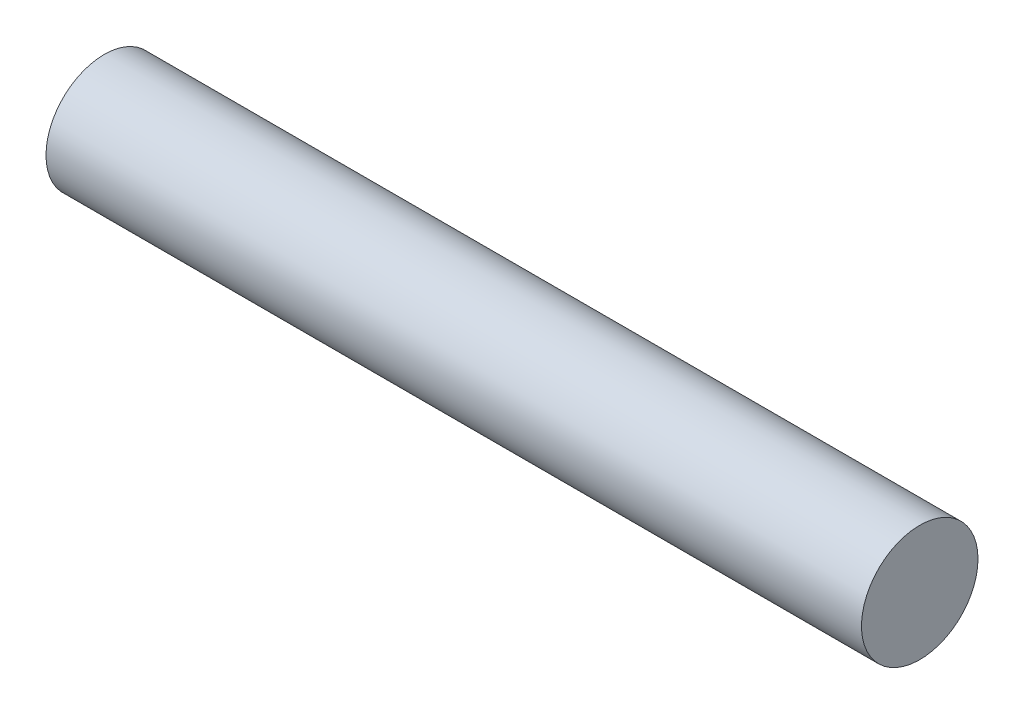
ISO-10303-21;
HEADER;
FILE_DESCRIPTION(('STEP AP214'),'2;1');
FILE_NAME('part.step','',(''),(''),'','','');
FILE_SCHEMA(('AUTOMOTIVE_DESIGN { 1 0 10303 214 1 1 1 1 }'));
ENDSEC;
DATA;
#1=APPLICATION_CONTEXT('core data for automotive mechanical design processes');
#2=APPLICATION_PROTOCOL_DEFINITION('international standard','automotive_design',2000,#1);
#3=PRODUCT_CONTEXT('',#1,'mechanical');
#4=PRODUCT('Part','Part','',(#3));
#5=PRODUCT_RELATED_PRODUCT_CATEGORY('part','',(#4));
#6=PRODUCT_DEFINITION_FORMATION('','',#4);
#7=PRODUCT_DEFINITION_CONTEXT('part definition',#1,'design');
#8=PRODUCT_DEFINITION('design','',#6,#7);
#9=PRODUCT_DEFINITION_SHAPE('','',#8);
#10=(LENGTH_UNIT() NAMED_UNIT(*) SI_UNIT(.MILLI.,.METRE.));
#11=(NAMED_UNIT(*) PLANE_ANGLE_UNIT() SI_UNIT($,.RADIAN.));
#12=(NAMED_UNIT(*) SI_UNIT($,.STERADIAN.) SOLID_ANGLE_UNIT());
#13=UNCERTAINTY_MEASURE_WITH_UNIT(LENGTH_MEASURE(1.E-05),#10,'distance_accuracy_value','');
#14=(GEOMETRIC_REPRESENTATION_CONTEXT(3) GLOBAL_UNCERTAINTY_ASSIGNED_CONTEXT((#13)) GLOBAL_UNIT_ASSIGNED_CONTEXT((#10,
#11,#12)) REPRESENTATION_CONTEXT('',''));
#15=CARTESIAN_POINT('',(0.,0.,0.));
#16=DIRECTION('',(0.,0.,1.));
#17=DIRECTION('',(1.,0.,0.));
#18=AXIS2_PLACEMENT_3D('',#15,#16,#17);
#19=CARTESIAN_POINT('',(-41.275,50.8,-155.801497182376));
#20=DIRECTION('',(-1.,0.,0.));
#21=DIRECTION('',(0.,0.,-1.));
#22=AXIS2_PLACEMENT_3D('',#19,#20,#21);
#23=PLANE('',#22);
#24=CARTESIAN_POINT('',(-41.275,82.55,-123.825));
#25=DIRECTION('',(-1.,0.,0.));
#26=DIRECTION('',(0.,0.,1.));
#27=AXIS2_PLACEMENT_3D('',#24,#25,#26);
#28=CIRCLE('',#27,6.34999999999998);
#29=CARTESIAN_POINT('',(-41.275,82.55,-117.475));
#30=VERTEX_POINT('',#29);
#31=EDGE_CURVE('E10',#30,#30,#28,.F.);
#32=ORIENTED_EDGE('',*,*,#31,.F.);
#33=EDGE_LOOP('',(#32));
#34=FACE_BOUND('',#33,.T.);
#35=ADVANCED_FACE('F35',(#34),#23,.T.);
#36=CARTESIAN_POINT('',(47.625,82.55,-123.825));
#37=DIRECTION('',(1.,0.,0.));
#38=DIRECTION('',(0.,0.,-1.));
#39=AXIS2_PLACEMENT_3D('',#36,#37,#38);
#40=PLANE('',#39);
#41=CARTESIAN_POINT('',(47.625,82.55,-123.825));
#42=DIRECTION('',(1.,0.,0.));
#43=DIRECTION('',(0.,0.,-1.));
#44=AXIS2_PLACEMENT_3D('',#41,#42,#43);
#45=CIRCLE('',#44,6.34999999999998);
#46=CARTESIAN_POINT('',(47.625,82.55,-130.175));
#47=VERTEX_POINT('',#46);
#48=EDGE_CURVE('E41',#47,#47,#45,.T.);
#49=ORIENTED_EDGE('',*,*,#48,.T.);
#50=EDGE_LOOP('',(#49));
#51=FACE_BOUND('',#50,.T.);
#52=ADVANCED_FACE('F47',(#51),#40,.T.);
#53=CARTESIAN_POINT('',(-59.2355122421383,82.55,-123.825));
#54=DIRECTION('',(1.,0.,0.));
#55=DIRECTION('',(0.,0.,-1.));
#56=AXIS2_PLACEMENT_3D('',#53,#54,#55);
#57=CYLINDRICAL_SURFACE('',#56,6.34999999999998);
#58=ORIENTED_EDGE('',*,*,#48,.F.);
#59=EDGE_LOOP('',(#58));
#60=FACE_BOUND('',#59,.T.);
#61=ORIENTED_EDGE('',*,*,#31,.T.);
#62=EDGE_LOOP('',(#61));
#63=FACE_BOUND('',#62,.T.);
#64=ADVANCED_FACE('F49',(#60,#63),#57,.T.);
#65=CLOSED_SHELL('',(#35,#52,#64));
#66=MANIFOLD_SOLID_BREP('B2',#65);
#67=ADVANCED_BREP_SHAPE_REPRESENTATION('',(#18,#66),#14);
#68=SHAPE_DEFINITION_REPRESENTATION(#9,#67);
ENDSEC;
END-ISO-10303-21;
